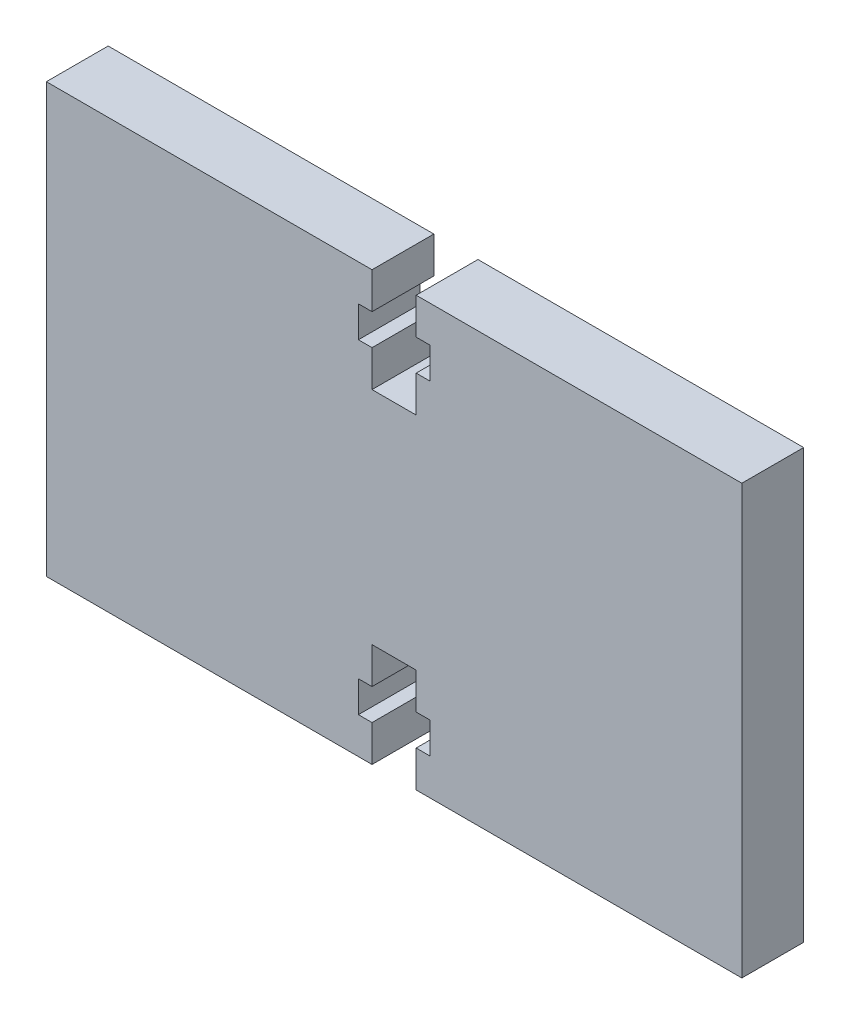
ISO-10303-21;
HEADER;
FILE_DESCRIPTION(('STEP AP214'),'2;1');
FILE_NAME('part.step','',(''),(''),'','','');
FILE_SCHEMA(('AUTOMOTIVE_DESIGN { 1 0 10303 214 1 1 1 1 }'));
ENDSEC;
DATA;
#1=APPLICATION_CONTEXT('core data for automotive mechanical design processes');
#2=APPLICATION_PROTOCOL_DEFINITION('international standard','automotive_design',2000,#1);
#3=PRODUCT_CONTEXT('',#1,'mechanical');
#4=PRODUCT('Part','Part','',(#3));
#5=PRODUCT_RELATED_PRODUCT_CATEGORY('part','',(#4));
#6=PRODUCT_DEFINITION_FORMATION('','',#4);
#7=PRODUCT_DEFINITION_CONTEXT('part definition',#1,'design');
#8=PRODUCT_DEFINITION('design','',#6,#7);
#9=PRODUCT_DEFINITION_SHAPE('','',#8);
#10=(LENGTH_UNIT() NAMED_UNIT(*) SI_UNIT(.MILLI.,.METRE.));
#11=(NAMED_UNIT(*) PLANE_ANGLE_UNIT() SI_UNIT($,.RADIAN.));
#12=(NAMED_UNIT(*) SI_UNIT($,.STERADIAN.) SOLID_ANGLE_UNIT());
#13=UNCERTAINTY_MEASURE_WITH_UNIT(LENGTH_MEASURE(1.E-05),#10,'distance_accuracy_value','');
#14=(GEOMETRIC_REPRESENTATION_CONTEXT(3) GLOBAL_UNCERTAINTY_ASSIGNED_CONTEXT((#13)) GLOBAL_UNIT_ASSIGNED_CONTEXT((#10,
#11,#12)) REPRESENTATION_CONTEXT('',''));
#15=CARTESIAN_POINT('',(0.,0.,0.));
#16=DIRECTION('',(0.,0.,1.));
#17=DIRECTION('',(1.,0.,0.));
#18=AXIS2_PLACEMENT_3D('',#15,#16,#17);
#19=CARTESIAN_POINT('',(-26.797,0.,4.7625));
#20=DIRECTION('',(-1.,0.,0.));
#21=DIRECTION('',(0.,0.,1.));
#22=AXIS2_PLACEMENT_3D('',#19,#20,#21);
#23=PLANE('',#22);
#24=DIRECTION('',(0.,1.,0.));
#25=VECTOR('',#24,1.);
#26=CARTESIAN_POINT('',(-26.797,0.,0.));
#27=LINE('',#26,#25);
#28=CARTESIAN_POINT('',(-26.797,-16.51,0.));
#29=VERTEX_POINT('',#28);
#30=CARTESIAN_POINT('',(-26.797,16.51,0.));
#31=VERTEX_POINT('',#30);
#32=EDGE_CURVE('E250',#29,#31,#27,.T.);
#33=ORIENTED_EDGE('',*,*,#32,.F.);
#34=DIRECTION('',(0.,0.,-1.));
#35=VECTOR('',#34,1.);
#36=CARTESIAN_POINT('',(-26.797,-16.51,4.7625));
#37=LINE('',#36,#35);
#38=CARTESIAN_POINT('',(-26.797,-16.51,4.7625));
#39=VERTEX_POINT('',#38);
#40=EDGE_CURVE('E11',#39,#29,#37,.T.);
#41=ORIENTED_EDGE('',*,*,#40,.F.);
#42=DIRECTION('',(0.,1.,0.));
#43=VECTOR('',#42,1.);
#44=CARTESIAN_POINT('',(-26.797,0.,4.7625));
#45=LINE('',#44,#43);
#46=CARTESIAN_POINT('',(-26.797,16.51,4.7625));
#47=VERTEX_POINT('',#46);
#48=EDGE_CURVE('E322',#39,#47,#45,.T.);
#49=ORIENTED_EDGE('',*,*,#48,.T.);
#50=DIRECTION('',(0.,0.,-1.));
#51=VECTOR('',#50,1.);
#52=CARTESIAN_POINT('',(-26.797,16.51,4.7625));
#53=LINE('',#52,#51);
#54=EDGE_CURVE('E52',#47,#31,#53,.T.);
#55=ORIENTED_EDGE('',*,*,#54,.T.);
#56=EDGE_LOOP('',(#33,#41,#49,#55));
#57=FACE_BOUND('',#56,.T.);
#58=ADVANCED_FACE('F36',(#57),#23,.T.);
#59=CARTESIAN_POINT('',(0.,-16.51,4.7625));
#60=DIRECTION('',(0.,1.,0.));
#61=DIRECTION('',(0.,0.,1.));
#62=AXIS2_PLACEMENT_3D('',#59,#60,#61);
#63=PLANE('',#62);
#64=DIRECTION('',(1.,0.,0.));
#65=VECTOR('',#64,1.);
#66=CARTESIAN_POINT('',(0.,-16.51,0.));
#67=LINE('',#66,#65);
#68=CARTESIAN_POINT('',(-1.7,-16.51,0.));
#69=VERTEX_POINT('',#68);
#70=EDGE_CURVE('E253',#29,#69,#67,.T.);
#71=ORIENTED_EDGE('',*,*,#70,.T.);
#72=DIRECTION('',(0.,0.,-1.));
#73=VECTOR('',#72,1.);
#74=CARTESIAN_POINT('',(-1.7,-16.51,4.7625));
#75=LINE('',#74,#73);
#76=CARTESIAN_POINT('',(-1.7,-16.51,4.7625));
#77=VERTEX_POINT('',#76);
#78=EDGE_CURVE('E44',#77,#69,#75,.T.);
#79=ORIENTED_EDGE('',*,*,#78,.F.);
#80=DIRECTION('',(1.,0.,0.));
#81=VECTOR('',#80,1.);
#82=CARTESIAN_POINT('',(0.,-16.51,4.7625));
#83=LINE('',#82,#81);
#84=EDGE_CURVE('E757',#39,#77,#83,.T.);
#85=ORIENTED_EDGE('',*,*,#84,.F.);
#86=ORIENTED_EDGE('',*,*,#40,.T.);
#87=EDGE_LOOP('',(#71,#79,#85,#86));
#88=FACE_BOUND('',#87,.T.);
#89=ADVANCED_FACE('F472',(#88),#63,.F.);
#90=CARTESIAN_POINT('',(-1.7,0.,4.7625));
#91=DIRECTION('',(-1.,0.,0.));
#92=DIRECTION('',(0.,-1.,0.));
#93=AXIS2_PLACEMENT_3D('',#90,#91,#92);
#94=PLANE('',#93);
#95=DIRECTION('',(0.,1.,0.));
#96=VECTOR('',#95,1.);
#97=CARTESIAN_POINT('',(-1.7,0.,0.));
#98=LINE('',#97,#96);
#99=CARTESIAN_POINT('',(-1.7,-13.71,0.));
#100=VERTEX_POINT('',#99);
#101=EDGE_CURVE('E255',#69,#100,#98,.T.);
#102=ORIENTED_EDGE('',*,*,#101,.T.);
#103=DIRECTION('',(0.,0.,-1.));
#104=VECTOR('',#103,1.);
#105=CARTESIAN_POINT('',(-1.7,-13.71,4.7625));
#106=LINE('',#105,#104);
#107=CARTESIAN_POINT('',(-1.7,-13.71,4.7625));
#108=VERTEX_POINT('',#107);
#109=EDGE_CURVE('E378',#108,#100,#106,.T.);
#110=ORIENTED_EDGE('',*,*,#109,.F.);
#111=DIRECTION('',(0.,1.,0.));
#112=VECTOR('',#111,1.);
#113=CARTESIAN_POINT('',(-1.7,0.,4.7625));
#114=LINE('',#113,#112);
#115=EDGE_CURVE('E388',#77,#108,#114,.T.);
#116=ORIENTED_EDGE('',*,*,#115,.F.);
#117=ORIENTED_EDGE('',*,*,#78,.T.);
#118=EDGE_LOOP('',(#102,#110,#116,#117));
#119=FACE_BOUND('',#118,.T.);
#120=ADVANCED_FACE('F386',(#119),#94,.F.);
#121=CARTESIAN_POINT('',(0.,-13.71,4.7625));
#122=DIRECTION('',(0.,-1.,0.));
#123=DIRECTION('',(0.,0.,-1.));
#124=AXIS2_PLACEMENT_3D('',#121,#122,#123);
#125=PLANE('',#124);
#126=DIRECTION('',(-1.,0.,0.));
#127=VECTOR('',#126,1.);
#128=CARTESIAN_POINT('',(0.,-13.71,0.));
#129=LINE('',#128,#127);
#130=CARTESIAN_POINT('',(-2.75,-13.71,0.));
#131=VERTEX_POINT('',#130);
#132=EDGE_CURVE('E258',#100,#131,#129,.T.);
#133=ORIENTED_EDGE('',*,*,#132,.T.);
#134=DIRECTION('',(0.,0.,-1.));
#135=VECTOR('',#134,1.);
#136=CARTESIAN_POINT('',(-2.75,-13.71,4.7625));
#137=LINE('',#136,#135);
#138=CARTESIAN_POINT('',(-2.75,-13.71,4.7625));
#139=VERTEX_POINT('',#138);
#140=EDGE_CURVE('E375',#139,#131,#137,.T.);
#141=ORIENTED_EDGE('',*,*,#140,.F.);
#142=DIRECTION('',(-1.,0.,0.));
#143=VECTOR('',#142,1.);
#144=CARTESIAN_POINT('',(0.,-13.71,4.7625));
#145=LINE('',#144,#143);
#146=EDGE_CURVE('E407',#108,#139,#145,.T.);
#147=ORIENTED_EDGE('',*,*,#146,.F.);
#148=ORIENTED_EDGE('',*,*,#109,.T.);
#149=EDGE_LOOP('',(#133,#141,#147,#148));
#150=FACE_BOUND('',#149,.T.);
#151=ADVANCED_FACE('F398',(#150),#125,.F.);
#152=CARTESIAN_POINT('',(-2.75,0.,4.7625));
#153=DIRECTION('',(-1.,0.,0.));
#154=DIRECTION('',(0.,0.,1.));
#155=AXIS2_PLACEMENT_3D('',#152,#153,#154);
#156=PLANE('',#155);
#157=DIRECTION('',(0.,1.,0.));
#158=VECTOR('',#157,1.);
#159=CARTESIAN_POINT('',(-2.75,0.,0.));
#160=LINE('',#159,#158);
#161=CARTESIAN_POINT('',(-2.75,-11.31,0.));
#162=VERTEX_POINT('',#161);
#163=EDGE_CURVE('E260',#131,#162,#160,.T.);
#164=ORIENTED_EDGE('',*,*,#163,.T.);
#165=DIRECTION('',(0.,0.,-1.));
#166=VECTOR('',#165,1.);
#167=CARTESIAN_POINT('',(-2.75,-11.31,4.7625));
#168=LINE('',#167,#166);
#169=CARTESIAN_POINT('',(-2.75,-11.31,4.7625));
#170=VERTEX_POINT('',#169);
#171=EDGE_CURVE('E372',#170,#162,#168,.T.);
#172=ORIENTED_EDGE('',*,*,#171,.F.);
#173=DIRECTION('',(0.,1.,0.));
#174=VECTOR('',#173,1.);
#175=CARTESIAN_POINT('',(-2.75,0.,4.7625));
#176=LINE('',#175,#174);
#177=EDGE_CURVE('E404',#139,#170,#176,.T.);
#178=ORIENTED_EDGE('',*,*,#177,.F.);
#179=ORIENTED_EDGE('',*,*,#140,.T.);
#180=EDGE_LOOP('',(#164,#172,#178,#179));
#181=FACE_BOUND('',#180,.T.);
#182=ADVANCED_FACE('F402',(#181),#156,.F.);
#183=CARTESIAN_POINT('',(0.,-11.31,4.7625));
#184=DIRECTION('',(0.,1.,0.));
#185=DIRECTION('',(0.,0.,1.));
#186=AXIS2_PLACEMENT_3D('',#183,#184,#185);
#187=PLANE('',#186);
#188=DIRECTION('',(1.,0.,0.));
#189=VECTOR('',#188,1.);
#190=CARTESIAN_POINT('',(0.,-11.31,0.));
#191=LINE('',#190,#189);
#192=CARTESIAN_POINT('',(-1.7,-11.31,0.));
#193=VERTEX_POINT('',#192);
#194=EDGE_CURVE('E262',#162,#193,#191,.T.);
#195=ORIENTED_EDGE('',*,*,#194,.T.);
#196=DIRECTION('',(0.,0.,-1.));
#197=VECTOR('',#196,1.);
#198=CARTESIAN_POINT('',(-1.7,-11.31,4.7625));
#199=LINE('',#198,#197);
#200=CARTESIAN_POINT('',(-1.7,-11.31,4.7625));
#201=VERTEX_POINT('',#200);
#202=EDGE_CURVE('E369',#201,#193,#199,.T.);
#203=ORIENTED_EDGE('',*,*,#202,.F.);
#204=DIRECTION('',(1.,0.,0.));
#205=VECTOR('',#204,1.);
#206=CARTESIAN_POINT('',(0.,-11.31,4.7625));
#207=LINE('',#206,#205);
#208=EDGE_CURVE('E406',#170,#201,#207,.T.);
#209=ORIENTED_EDGE('',*,*,#208,.F.);
#210=ORIENTED_EDGE('',*,*,#171,.T.);
#211=EDGE_LOOP('',(#195,#203,#209,#210));
#212=FACE_BOUND('',#211,.T.);
#213=ADVANCED_FACE('F485',(#212),#187,.F.);
#214=CARTESIAN_POINT('',(-1.7,0.,4.7625));
#215=DIRECTION('',(-1.,0.,0.));
#216=DIRECTION('',(0.,-1.,0.));
#217=AXIS2_PLACEMENT_3D('',#214,#215,#216);
#218=PLANE('',#217);
#219=DIRECTION('',(0.,1.,0.));
#220=VECTOR('',#219,1.);
#221=CARTESIAN_POINT('',(-1.7,0.,0.));
#222=LINE('',#221,#220);
#223=CARTESIAN_POINT('',(-1.7,-8.51,0.));
#224=VERTEX_POINT('',#223);
#225=EDGE_CURVE('E264',#193,#224,#222,.T.);
#226=ORIENTED_EDGE('',*,*,#225,.T.);
#227=DIRECTION('',(0.,0.,-1.));
#228=VECTOR('',#227,1.);
#229=CARTESIAN_POINT('',(-1.7,-8.51,4.7625));
#230=LINE('',#229,#228);
#231=CARTESIAN_POINT('',(-1.7,-8.51,4.7625));
#232=VERTEX_POINT('',#231);
#233=EDGE_CURVE('E366',#232,#224,#230,.T.);
#234=ORIENTED_EDGE('',*,*,#233,.F.);
#235=DIRECTION('',(0.,1.,0.));
#236=VECTOR('',#235,1.);
#237=CARTESIAN_POINT('',(-1.7,0.,4.7625));
#238=LINE('',#237,#236);
#239=EDGE_CURVE('E409',#201,#232,#238,.T.);
#240=ORIENTED_EDGE('',*,*,#239,.F.);
#241=ORIENTED_EDGE('',*,*,#202,.T.);
#242=EDGE_LOOP('',(#226,#234,#240,#241));
#243=FACE_BOUND('',#242,.T.);
#244=ADVANCED_FACE('F488',(#243),#218,.F.);
#245=CARTESIAN_POINT('',(0.,-8.51,4.7625));
#246=DIRECTION('',(0.,1.,0.));
#247=DIRECTION('',(-1.,0.,0.));
#248=AXIS2_PLACEMENT_3D('',#245,#246,#247);
#249=PLANE('',#248);
#250=DIRECTION('',(1.,0.,0.));
#251=VECTOR('',#250,1.);
#252=CARTESIAN_POINT('',(0.,-8.51,0.));
#253=LINE('',#252,#251);
#254=CARTESIAN_POINT('',(1.69999999999997,-8.51,0.));
#255=VERTEX_POINT('',#254);
#256=EDGE_CURVE('E266',#224,#255,#253,.T.);
#257=ORIENTED_EDGE('',*,*,#256,.T.);
#258=DIRECTION('',(0.,0.,-1.));
#259=VECTOR('',#258,1.);
#260=CARTESIAN_POINT('',(1.69999999999997,-8.51,4.7625));
#261=LINE('',#260,#259);
#262=CARTESIAN_POINT('',(1.69999999999997,-8.51,4.7625));
#263=VERTEX_POINT('',#262);
#264=EDGE_CURVE('E364',#263,#255,#261,.T.);
#265=ORIENTED_EDGE('',*,*,#264,.F.);
#266=DIRECTION('',(1.,0.,0.));
#267=VECTOR('',#266,1.);
#268=CARTESIAN_POINT('',(0.,-8.51,4.7625));
#269=LINE('',#268,#267);
#270=EDGE_CURVE('E415',#232,#263,#269,.T.);
#271=ORIENTED_EDGE('',*,*,#270,.F.);
#272=ORIENTED_EDGE('',*,*,#233,.T.);
#273=EDGE_LOOP('',(#257,#265,#271,#272));
#274=FACE_BOUND('',#273,.T.);
#275=ADVANCED_FACE('F492',(#274),#249,.F.);
#276=CARTESIAN_POINT('',(1.69999999999988,0.,4.7625));
#277=DIRECTION('',(-1.,0.,0.));
#278=DIRECTION('',(0.,-1.,0.));
#279=AXIS2_PLACEMENT_3D('',#276,#277,#278);
#280=PLANE('',#279);
#281=DIRECTION('',(0.,1.,0.));
#282=VECTOR('',#281,1.);
#283=CARTESIAN_POINT('',(1.69999999999988,0.,0.));
#284=LINE('',#283,#282);
#285=CARTESIAN_POINT('',(1.7,-11.31,0.));
#286=VERTEX_POINT('',#285);
#287=EDGE_CURVE('E269',#286,#255,#284,.T.);
#288=ORIENTED_EDGE('',*,*,#287,.F.);
#289=DIRECTION('',(0.,0.,-1.));
#290=VECTOR('',#289,1.);
#291=CARTESIAN_POINT('',(1.7,-11.31,4.7625));
#292=LINE('',#291,#290);
#293=CARTESIAN_POINT('',(1.7,-11.31,4.7625));
#294=VERTEX_POINT('',#293);
#295=EDGE_CURVE('E362',#294,#286,#292,.T.);
#296=ORIENTED_EDGE('',*,*,#295,.F.);
#297=DIRECTION('',(0.,1.,0.));
#298=VECTOR('',#297,1.);
#299=CARTESIAN_POINT('',(1.69999999999988,0.,4.7625));
#300=LINE('',#299,#298);
#301=EDGE_CURVE('E417',#294,#263,#300,.T.);
#302=ORIENTED_EDGE('',*,*,#301,.T.);
#303=ORIENTED_EDGE('',*,*,#264,.T.);
#304=EDGE_LOOP('',(#288,#296,#302,#303));
#305=FACE_BOUND('',#304,.T.);
#306=ADVANCED_FACE('F496',(#305),#280,.T.);
#307=CARTESIAN_POINT('',(0.,-11.31,4.7625));
#308=DIRECTION('',(0.,-1.,0.));
#309=DIRECTION('',(0.,0.,-1.));
#310=AXIS2_PLACEMENT_3D('',#307,#308,#309);
#311=PLANE('',#310);
#312=DIRECTION('',(-1.,0.,0.));
#313=VECTOR('',#312,1.);
#314=CARTESIAN_POINT('',(0.,-11.31,0.));
#315=LINE('',#314,#313);
#316=CARTESIAN_POINT('',(2.75,-11.31,0.));
#317=VERTEX_POINT('',#316);
#318=EDGE_CURVE('E272',#317,#286,#315,.T.);
#319=ORIENTED_EDGE('',*,*,#318,.F.);
#320=DIRECTION('',(0.,0.,-1.));
#321=VECTOR('',#320,1.);
#322=CARTESIAN_POINT('',(2.75,-11.31,4.7625));
#323=LINE('',#322,#321);
#324=CARTESIAN_POINT('',(2.75,-11.31,4.7625));
#325=VERTEX_POINT('',#324);
#326=EDGE_CURVE('E360',#325,#317,#323,.T.);
#327=ORIENTED_EDGE('',*,*,#326,.F.);
#328=DIRECTION('',(-1.,0.,0.));
#329=VECTOR('',#328,1.);
#330=CARTESIAN_POINT('',(0.,-11.31,4.7625));
#331=LINE('',#330,#329);
#332=EDGE_CURVE('E420',#325,#294,#331,.T.);
#333=ORIENTED_EDGE('',*,*,#332,.T.);
#334=ORIENTED_EDGE('',*,*,#295,.T.);
#335=EDGE_LOOP('',(#319,#327,#333,#334));
#336=FACE_BOUND('',#335,.T.);
#337=ADVANCED_FACE('F500',(#336),#311,.T.);
#338=CARTESIAN_POINT('',(2.75,0.,4.7625));
#339=DIRECTION('',(-1.,0.,0.));
#340=DIRECTION('',(0.,0.,1.));
#341=AXIS2_PLACEMENT_3D('',#338,#339,#340);
#342=PLANE('',#341);
#343=DIRECTION('',(0.,1.,0.));
#344=VECTOR('',#343,1.);
#345=CARTESIAN_POINT('',(2.75,0.,0.));
#346=LINE('',#345,#344);
#347=CARTESIAN_POINT('',(2.75,-13.71,0.));
#348=VERTEX_POINT('',#347);
#349=EDGE_CURVE('E275',#348,#317,#346,.T.);
#350=ORIENTED_EDGE('',*,*,#349,.F.);
#351=DIRECTION('',(0.,0.,-1.));
#352=VECTOR('',#351,1.);
#353=CARTESIAN_POINT('',(2.75,-13.71,4.7625));
#354=LINE('',#353,#352);
#355=CARTESIAN_POINT('',(2.75,-13.71,4.7625));
#356=VERTEX_POINT('',#355);
#357=EDGE_CURVE('E358',#356,#348,#354,.T.);
#358=ORIENTED_EDGE('',*,*,#357,.F.);
#359=DIRECTION('',(0.,1.,0.));
#360=VECTOR('',#359,1.);
#361=CARTESIAN_POINT('',(2.75,0.,4.7625));
#362=LINE('',#361,#360);
#363=EDGE_CURVE('E423',#356,#325,#362,.T.);
#364=ORIENTED_EDGE('',*,*,#363,.T.);
#365=ORIENTED_EDGE('',*,*,#326,.T.);
#366=EDGE_LOOP('',(#350,#358,#364,#365));
#367=FACE_BOUND('',#366,.T.);
#368=ADVANCED_FACE('F504',(#367),#342,.T.);
#369=CARTESIAN_POINT('',(0.,-13.71,4.7625));
#370=DIRECTION('',(0.,1.,0.));
#371=DIRECTION('',(0.,0.,1.));
#372=AXIS2_PLACEMENT_3D('',#369,#370,#371);
#373=PLANE('',#372);
#374=DIRECTION('',(1.,0.,0.));
#375=VECTOR('',#374,1.);
#376=CARTESIAN_POINT('',(0.,-13.71,0.));
#377=LINE('',#376,#375);
#378=CARTESIAN_POINT('',(1.7,-13.71,0.));
#379=VERTEX_POINT('',#378);
#380=EDGE_CURVE('E278',#379,#348,#377,.T.);
#381=ORIENTED_EDGE('',*,*,#380,.F.);
#382=DIRECTION('',(0.,0.,-1.));
#383=VECTOR('',#382,1.);
#384=CARTESIAN_POINT('',(1.7,-13.71,4.7625));
#385=LINE('',#384,#383);
#386=CARTESIAN_POINT('',(1.7,-13.71,4.7625));
#387=VERTEX_POINT('',#386);
#388=EDGE_CURVE('E356',#387,#379,#385,.T.);
#389=ORIENTED_EDGE('',*,*,#388,.F.);
#390=DIRECTION('',(1.,0.,0.));
#391=VECTOR('',#390,1.);
#392=CARTESIAN_POINT('',(0.,-13.71,4.7625));
#393=LINE('',#392,#391);
#394=EDGE_CURVE('E426',#387,#356,#393,.T.);
#395=ORIENTED_EDGE('',*,*,#394,.T.);
#396=ORIENTED_EDGE('',*,*,#357,.T.);
#397=EDGE_LOOP('',(#381,#389,#395,#396));
#398=FACE_BOUND('',#397,.T.);
#399=ADVANCED_FACE('F508',(#398),#373,.T.);
#400=CARTESIAN_POINT('',(1.70000000000004,0.,4.7625));
#401=DIRECTION('',(-1.,0.,0.));
#402=DIRECTION('',(0.,-1.,0.));
#403=AXIS2_PLACEMENT_3D('',#400,#401,#402);
#404=PLANE('',#403);
#405=DIRECTION('',(0.,1.,0.));
#406=VECTOR('',#405,1.);
#407=CARTESIAN_POINT('',(1.70000000000004,0.,0.));
#408=LINE('',#407,#406);
#409=CARTESIAN_POINT('',(1.69999999999999,-16.51,0.));
#410=VERTEX_POINT('',#409);
#411=EDGE_CURVE('E281',#410,#379,#408,.T.);
#412=ORIENTED_EDGE('',*,*,#411,.F.);
#413=DIRECTION('',(0.,0.,-1.));
#414=VECTOR('',#413,1.);
#415=CARTESIAN_POINT('',(1.69999999999999,-16.51,4.7625));
#416=LINE('',#415,#414);
#417=CARTESIAN_POINT('',(1.69999999999999,-16.51,4.7625));
#418=VERTEX_POINT('',#417);
#419=EDGE_CURVE('E354',#418,#410,#416,.T.);
#420=ORIENTED_EDGE('',*,*,#419,.F.);
#421=DIRECTION('',(0.,1.,0.));
#422=VECTOR('',#421,1.);
#423=CARTESIAN_POINT('',(1.70000000000004,0.,4.7625));
#424=LINE('',#423,#422);
#425=EDGE_CURVE('E429',#418,#387,#424,.T.);
#426=ORIENTED_EDGE('',*,*,#425,.T.);
#427=ORIENTED_EDGE('',*,*,#388,.T.);
#428=EDGE_LOOP('',(#412,#420,#426,#427));
#429=FACE_BOUND('',#428,.T.);
#430=ADVANCED_FACE('F512',(#429),#404,.T.);
#431=CARTESIAN_POINT('',(0.,-16.51,4.7625));
#432=DIRECTION('',(0.,1.,0.));
#433=DIRECTION('',(-1.,0.,0.));
#434=AXIS2_PLACEMENT_3D('',#431,#432,#433);
#435=PLANE('',#434);
#436=DIRECTION('',(1.,0.,0.));
#437=VECTOR('',#436,1.);
#438=CARTESIAN_POINT('',(0.,-16.51,0.));
#439=LINE('',#438,#437);
#440=CARTESIAN_POINT('',(26.797,-16.51,0.));
#441=VERTEX_POINT('',#440);
#442=EDGE_CURVE('E284',#410,#441,#439,.T.);
#443=ORIENTED_EDGE('',*,*,#442,.T.);
#444=DIRECTION('',(0.,0.,-1.));
#445=VECTOR('',#444,1.);
#446=CARTESIAN_POINT('',(26.797,-16.51,4.7625));
#447=LINE('',#446,#445);
#448=CARTESIAN_POINT('',(26.797,-16.51,4.7625));
#449=VERTEX_POINT('',#448);
#450=EDGE_CURVE('E351',#449,#441,#447,.T.);
#451=ORIENTED_EDGE('',*,*,#450,.F.);
#452=DIRECTION('',(1.,0.,0.));
#453=VECTOR('',#452,1.);
#454=CARTESIAN_POINT('',(0.,-16.51,4.7625));
#455=LINE('',#454,#453);
#456=EDGE_CURVE('E432',#418,#449,#455,.T.);
#457=ORIENTED_EDGE('',*,*,#456,.F.);
#458=ORIENTED_EDGE('',*,*,#419,.T.);
#459=EDGE_LOOP('',(#443,#451,#457,#458));
#460=FACE_BOUND('',#459,.T.);
#461=ADVANCED_FACE('F516',(#460),#435,.F.);
#462=CARTESIAN_POINT('',(26.797,0.,4.7625));
#463=DIRECTION('',(-1.,0.,0.));
#464=DIRECTION('',(0.,0.,1.));
#465=AXIS2_PLACEMENT_3D('',#462,#463,#464);
#466=PLANE('',#465);
#467=DIRECTION('',(0.,1.,0.));
#468=VECTOR('',#467,1.);
#469=CARTESIAN_POINT('',(26.797,0.,0.));
#470=LINE('',#469,#468);
#471=CARTESIAN_POINT('',(26.797,16.51,0.));
#472=VERTEX_POINT('',#471);
#473=EDGE_CURVE('E286',#441,#472,#470,.T.);
#474=ORIENTED_EDGE('',*,*,#473,.T.);
#475=DIRECTION('',(0.,0.,-1.));
#476=VECTOR('',#475,1.);
#477=CARTESIAN_POINT('',(26.797,16.51,4.7625));
#478=LINE('',#477,#476);
#479=CARTESIAN_POINT('',(26.797,16.51,4.7625));
#480=VERTEX_POINT('',#479);
#481=EDGE_CURVE('E349',#480,#472,#478,.T.);
#482=ORIENTED_EDGE('',*,*,#481,.F.);
#483=DIRECTION('',(0.,1.,0.));
#484=VECTOR('',#483,1.);
#485=CARTESIAN_POINT('',(26.797,0.,4.7625));
#486=LINE('',#485,#484);
#487=EDGE_CURVE('E434',#449,#480,#486,.T.);
#488=ORIENTED_EDGE('',*,*,#487,.F.);
#489=ORIENTED_EDGE('',*,*,#450,.T.);
#490=EDGE_LOOP('',(#474,#482,#488,#489));
#491=FACE_BOUND('',#490,.T.);
#492=ADVANCED_FACE('F520',(#491),#466,.F.);
#493=CARTESIAN_POINT('',(0.,16.51,4.7625));
#494=DIRECTION('',(0.,1.,0.));
#495=DIRECTION('',(-1.,0.,0.));
#496=AXIS2_PLACEMENT_3D('',#493,#494,#495);
#497=PLANE('',#496);
#498=DIRECTION('',(1.,0.,0.));
#499=VECTOR('',#498,1.);
#500=CARTESIAN_POINT('',(0.,16.51,0.));
#501=LINE('',#500,#499);
#502=CARTESIAN_POINT('',(1.69999999999999,16.51,0.));
#503=VERTEX_POINT('',#502);
#504=EDGE_CURVE('E289',#503,#472,#501,.T.);
#505=ORIENTED_EDGE('',*,*,#504,.F.);
#506=DIRECTION('',(0.,0.,-1.));
#507=VECTOR('',#506,1.);
#508=CARTESIAN_POINT('',(1.69999999999999,16.51,4.7625));
#509=LINE('',#508,#507);
#510=CARTESIAN_POINT('',(1.69999999999999,16.51,4.7625));
#511=VERTEX_POINT('',#510);
#512=EDGE_CURVE('E347',#511,#503,#509,.T.);
#513=ORIENTED_EDGE('',*,*,#512,.F.);
#514=DIRECTION('',(1.,0.,0.));
#515=VECTOR('',#514,1.);
#516=CARTESIAN_POINT('',(0.,16.51,4.7625));
#517=LINE('',#516,#515);
#518=EDGE_CURVE('E436',#511,#480,#517,.T.);
#519=ORIENTED_EDGE('',*,*,#518,.T.);
#520=ORIENTED_EDGE('',*,*,#481,.T.);
#521=EDGE_LOOP('',(#505,#513,#519,#520));
#522=FACE_BOUND('',#521,.T.);
#523=ADVANCED_FACE('F524',(#522),#497,.T.);
#524=CARTESIAN_POINT('',(1.70000000000004,0.,4.7625));
#525=DIRECTION('',(1.,0.,0.));
#526=DIRECTION('',(0.,1.,0.));
#527=AXIS2_PLACEMENT_3D('',#524,#525,#526);
#528=PLANE('',#527);
#529=DIRECTION('',(0.,-1.,0.));
#530=VECTOR('',#529,1.);
#531=CARTESIAN_POINT('',(1.70000000000004,0.,0.));
#532=LINE('',#531,#530);
#533=CARTESIAN_POINT('',(1.7,13.71,0.));
#534=VERTEX_POINT('',#533);
#535=EDGE_CURVE('E292',#503,#534,#532,.T.);
#536=ORIENTED_EDGE('',*,*,#535,.T.);
#537=DIRECTION('',(0.,0.,-1.));
#538=VECTOR('',#537,1.);
#539=CARTESIAN_POINT('',(1.7,13.71,4.7625));
#540=LINE('',#539,#538);
#541=CARTESIAN_POINT('',(1.7,13.71,4.7625));
#542=VERTEX_POINT('',#541);
#543=EDGE_CURVE('E344',#542,#534,#540,.T.);
#544=ORIENTED_EDGE('',*,*,#543,.F.);
#545=DIRECTION('',(0.,-1.,0.));
#546=VECTOR('',#545,1.);
#547=CARTESIAN_POINT('',(1.70000000000004,0.,4.7625));
#548=LINE('',#547,#546);
#549=EDGE_CURVE('E439',#511,#542,#548,.T.);
#550=ORIENTED_EDGE('',*,*,#549,.F.);
#551=ORIENTED_EDGE('',*,*,#512,.T.);
#552=EDGE_LOOP('',(#536,#544,#550,#551));
#553=FACE_BOUND('',#552,.T.);
#554=ADVANCED_FACE('F528',(#553),#528,.F.);
#555=CARTESIAN_POINT('',(0.,13.71,4.7625));
#556=DIRECTION('',(0.,1.,0.));
#557=DIRECTION('',(0.,0.,1.));
#558=AXIS2_PLACEMENT_3D('',#555,#556,#557);
#559=PLANE('',#558);
#560=DIRECTION('',(1.,0.,0.));
#561=VECTOR('',#560,1.);
#562=CARTESIAN_POINT('',(0.,13.71,0.));
#563=LINE('',#562,#561);
#564=CARTESIAN_POINT('',(2.75,13.71,0.));
#565=VERTEX_POINT('',#564);
#566=EDGE_CURVE('E295',#534,#565,#563,.T.);
#567=ORIENTED_EDGE('',*,*,#566,.T.);
#568=DIRECTION('',(0.,0.,-1.));
#569=VECTOR('',#568,1.);
#570=CARTESIAN_POINT('',(2.75,13.71,4.7625));
#571=LINE('',#570,#569);
#572=CARTESIAN_POINT('',(2.75,13.71,4.7625));
#573=VERTEX_POINT('',#572);
#574=EDGE_CURVE('E341',#573,#565,#571,.T.);
#575=ORIENTED_EDGE('',*,*,#574,.F.);
#576=DIRECTION('',(1.,0.,0.));
#577=VECTOR('',#576,1.);
#578=CARTESIAN_POINT('',(0.,13.71,4.7625));
#579=LINE('',#578,#577);
#580=EDGE_CURVE('E441',#542,#573,#579,.T.);
#581=ORIENTED_EDGE('',*,*,#580,.F.);
#582=ORIENTED_EDGE('',*,*,#543,.T.);
#583=EDGE_LOOP('',(#567,#575,#581,#582));
#584=FACE_BOUND('',#583,.T.);
#585=ADVANCED_FACE('F532',(#584),#559,.F.);
#586=CARTESIAN_POINT('',(2.75,0.,4.7625));
#587=DIRECTION('',(1.,0.,0.));
#588=DIRECTION('',(0.,0.,-1.));
#589=AXIS2_PLACEMENT_3D('',#586,#587,#588);
#590=PLANE('',#589);
#591=DIRECTION('',(0.,-1.,0.));
#592=VECTOR('',#591,1.);
#593=CARTESIAN_POINT('',(2.75,0.,0.));
#594=LINE('',#593,#592);
#595=CARTESIAN_POINT('',(2.75,11.31,0.));
#596=VERTEX_POINT('',#595);
#597=EDGE_CURVE('E297',#565,#596,#594,.T.);
#598=ORIENTED_EDGE('',*,*,#597,.T.);
#599=DIRECTION('',(0.,0.,-1.));
#600=VECTOR('',#599,1.);
#601=CARTESIAN_POINT('',(2.75,11.31,4.7625));
#602=LINE('',#601,#600);
#603=CARTESIAN_POINT('',(2.75,11.31,4.7625));
#604=VERTEX_POINT('',#603);
#605=EDGE_CURVE('E338',#604,#596,#602,.T.);
#606=ORIENTED_EDGE('',*,*,#605,.F.);
#607=DIRECTION('',(0.,-1.,0.));
#608=VECTOR('',#607,1.);
#609=CARTESIAN_POINT('',(2.75,0.,4.7625));
#610=LINE('',#609,#608);
#611=EDGE_CURVE('E443',#573,#604,#610,.T.);
#612=ORIENTED_EDGE('',*,*,#611,.F.);
#613=ORIENTED_EDGE('',*,*,#574,.T.);
#614=EDGE_LOOP('',(#598,#606,#612,#613));
#615=FACE_BOUND('',#614,.T.);
#616=ADVANCED_FACE('F536',(#615),#590,.F.);
#617=CARTESIAN_POINT('',(0.,11.31,4.7625));
#618=DIRECTION('',(0.,-1.,0.));
#619=DIRECTION('',(0.,0.,-1.));
#620=AXIS2_PLACEMENT_3D('',#617,#618,#619);
#621=PLANE('',#620);
#622=DIRECTION('',(-1.,0.,0.));
#623=VECTOR('',#622,1.);
#624=CARTESIAN_POINT('',(0.,11.31,0.));
#625=LINE('',#624,#623);
#626=CARTESIAN_POINT('',(1.7,11.31,0.));
#627=VERTEX_POINT('',#626);
#628=EDGE_CURVE('E299',#596,#627,#625,.T.);
#629=ORIENTED_EDGE('',*,*,#628,.T.);
#630=DIRECTION('',(0.,0.,-1.));
#631=VECTOR('',#630,1.);
#632=CARTESIAN_POINT('',(1.7,11.31,4.7625));
#633=LINE('',#632,#631);
#634=CARTESIAN_POINT('',(1.7,11.31,4.7625));
#635=VERTEX_POINT('',#634);
#636=EDGE_CURVE('E334',#635,#627,#633,.T.);
#637=ORIENTED_EDGE('',*,*,#636,.F.);
#638=DIRECTION('',(-1.,0.,0.));
#639=VECTOR('',#638,1.);
#640=CARTESIAN_POINT('',(0.,11.31,4.7625));
#641=LINE('',#640,#639);
#642=EDGE_CURVE('E445',#604,#635,#641,.T.);
#643=ORIENTED_EDGE('',*,*,#642,.F.);
#644=ORIENTED_EDGE('',*,*,#605,.T.);
#645=EDGE_LOOP('',(#629,#637,#643,#644));
#646=FACE_BOUND('',#645,.T.);
#647=ADVANCED_FACE('F540',(#646),#621,.F.);
#648=CARTESIAN_POINT('',(1.69999999999988,0.,4.7625));
#649=DIRECTION('',(1.,0.,0.));
#650=DIRECTION('',(0.,1.,0.));
#651=AXIS2_PLACEMENT_3D('',#648,#649,#650);
#652=PLANE('',#651);
#653=DIRECTION('',(0.,-1.,0.));
#654=VECTOR('',#653,1.);
#655=CARTESIAN_POINT('',(1.69999999999988,0.,0.));
#656=LINE('',#655,#654);
#657=CARTESIAN_POINT('',(1.69999999999997,8.51,0.));
#658=VERTEX_POINT('',#657);
#659=EDGE_CURVE('E301',#627,#658,#656,.T.);
#660=ORIENTED_EDGE('',*,*,#659,.T.);
#661=DIRECTION('',(0.,0.,-1.));
#662=VECTOR('',#661,1.);
#663=CARTESIAN_POINT('',(1.69999999999997,8.51,4.7625));
#664=LINE('',#663,#662);
#665=CARTESIAN_POINT('',(1.69999999999997,8.51,4.7625));
#666=VERTEX_POINT('',#665);
#667=EDGE_CURVE('E332',#666,#658,#664,.T.);
#668=ORIENTED_EDGE('',*,*,#667,.F.);
#669=DIRECTION('',(0.,-1.,0.));
#670=VECTOR('',#669,1.);
#671=CARTESIAN_POINT('',(1.69999999999988,0.,4.7625));
#672=LINE('',#671,#670);
#673=EDGE_CURVE('E447',#635,#666,#672,.T.);
#674=ORIENTED_EDGE('',*,*,#673,.F.);
#675=ORIENTED_EDGE('',*,*,#636,.T.);
#676=EDGE_LOOP('',(#660,#668,#674,#675));
#677=FACE_BOUND('',#676,.T.);
#678=ADVANCED_FACE('F544',(#677),#652,.F.);
#679=CARTESIAN_POINT('',(0.,8.51,4.7625));
#680=DIRECTION('',(0.,1.,0.));
#681=DIRECTION('',(-1.,0.,0.));
#682=AXIS2_PLACEMENT_3D('',#679,#680,#681);
#683=PLANE('',#682);
#684=DIRECTION('',(1.,0.,0.));
#685=VECTOR('',#684,1.);
#686=CARTESIAN_POINT('',(0.,8.51,0.));
#687=LINE('',#686,#685);
#688=CARTESIAN_POINT('',(-1.7,8.51,0.));
#689=VERTEX_POINT('',#688);
#690=EDGE_CURVE('E304',#689,#658,#687,.T.);
#691=ORIENTED_EDGE('',*,*,#690,.F.);
#692=DIRECTION('',(0.,0.,-1.));
#693=VECTOR('',#692,1.);
#694=CARTESIAN_POINT('',(-1.7,8.51,4.7625));
#695=LINE('',#694,#693);
#696=CARTESIAN_POINT('',(-1.7,8.51,4.7625));
#697=VERTEX_POINT('',#696);
#698=EDGE_CURVE('E330',#697,#689,#695,.T.);
#699=ORIENTED_EDGE('',*,*,#698,.F.);
#700=DIRECTION('',(1.,0.,0.));
#701=VECTOR('',#700,1.);
#702=CARTESIAN_POINT('',(0.,8.51,4.7625));
#703=LINE('',#702,#701);
#704=EDGE_CURVE('E449',#697,#666,#703,.T.);
#705=ORIENTED_EDGE('',*,*,#704,.T.);
#706=ORIENTED_EDGE('',*,*,#667,.T.);
#707=EDGE_LOOP('',(#691,#699,#705,#706));
#708=FACE_BOUND('',#707,.T.);
#709=ADVANCED_FACE('F548',(#708),#683,.T.);
#710=CARTESIAN_POINT('',(-1.7,0.,4.7625));
#711=DIRECTION('',(1.,0.,0.));
#712=DIRECTION('',(0.,1.,0.));
#713=AXIS2_PLACEMENT_3D('',#710,#711,#712);
#714=PLANE('',#713);
#715=DIRECTION('',(0.,-1.,0.));
#716=VECTOR('',#715,1.);
#717=CARTESIAN_POINT('',(-1.7,0.,0.));
#718=LINE('',#717,#716);
#719=CARTESIAN_POINT('',(-1.7,11.31,0.));
#720=VERTEX_POINT('',#719);
#721=EDGE_CURVE('E307',#720,#689,#718,.T.);
#722=ORIENTED_EDGE('',*,*,#721,.F.);
#723=DIRECTION('',(0.,0.,-1.));
#724=VECTOR('',#723,1.);
#725=CARTESIAN_POINT('',(-1.7,11.31,4.7625));
#726=LINE('',#725,#724);
#727=CARTESIAN_POINT('',(-1.7,11.31,4.7625));
#728=VERTEX_POINT('',#727);
#729=EDGE_CURVE('E328',#728,#720,#726,.T.);
#730=ORIENTED_EDGE('',*,*,#729,.F.);
#731=DIRECTION('',(0.,-1.,0.));
#732=VECTOR('',#731,1.);
#733=CARTESIAN_POINT('',(-1.7,0.,4.7625));
#734=LINE('',#733,#732);
#735=EDGE_CURVE('E452',#728,#697,#734,.T.);
#736=ORIENTED_EDGE('',*,*,#735,.T.);
#737=ORIENTED_EDGE('',*,*,#698,.T.);
#738=EDGE_LOOP('',(#722,#730,#736,#737));
#739=FACE_BOUND('',#738,.T.);
#740=ADVANCED_FACE('F552',(#739),#714,.T.);
#741=CARTESIAN_POINT('',(0.,11.31,4.7625));
#742=DIRECTION('',(0.,1.,0.));
#743=DIRECTION('',(0.,0.,1.));
#744=AXIS2_PLACEMENT_3D('',#741,#742,#743);
#745=PLANE('',#744);
#746=DIRECTION('',(1.,0.,0.));
#747=VECTOR('',#746,1.);
#748=CARTESIAN_POINT('',(0.,11.31,0.));
#749=LINE('',#748,#747);
#750=CARTESIAN_POINT('',(-2.75,11.31,0.));
#751=VERTEX_POINT('',#750);
#752=EDGE_CURVE('E310',#751,#720,#749,.T.);
#753=ORIENTED_EDGE('',*,*,#752,.F.);
#754=DIRECTION('',(0.,0.,-1.));
#755=VECTOR('',#754,1.);
#756=CARTESIAN_POINT('',(-2.75,11.31,4.7625));
#757=LINE('',#756,#755);
#758=CARTESIAN_POINT('',(-2.75,11.31,4.7625));
#759=VERTEX_POINT('',#758);
#760=EDGE_CURVE('E326',#759,#751,#757,.T.);
#761=ORIENTED_EDGE('',*,*,#760,.F.);
#762=DIRECTION('',(1.,0.,0.));
#763=VECTOR('',#762,1.);
#764=CARTESIAN_POINT('',(0.,11.31,4.7625));
#765=LINE('',#764,#763);
#766=EDGE_CURVE('E455',#759,#728,#765,.T.);
#767=ORIENTED_EDGE('',*,*,#766,.T.);
#768=ORIENTED_EDGE('',*,*,#729,.T.);
#769=EDGE_LOOP('',(#753,#761,#767,#768));
#770=FACE_BOUND('',#769,.T.);
#771=ADVANCED_FACE('F556',(#770),#745,.T.);
#772=CARTESIAN_POINT('',(-2.75,0.,4.7625));
#773=DIRECTION('',(1.,0.,0.));
#774=DIRECTION('',(0.,0.,-1.));
#775=AXIS2_PLACEMENT_3D('',#772,#773,#774);
#776=PLANE('',#775);
#777=DIRECTION('',(0.,-1.,0.));
#778=VECTOR('',#777,1.);
#779=CARTESIAN_POINT('',(-2.75,0.,0.));
#780=LINE('',#779,#778);
#781=CARTESIAN_POINT('',(-2.75,13.71,0.));
#782=VERTEX_POINT('',#781);
#783=EDGE_CURVE('E313',#782,#751,#780,.T.);
#784=ORIENTED_EDGE('',*,*,#783,.F.);
#785=DIRECTION('',(0.,0.,-1.));
#786=VECTOR('',#785,1.);
#787=CARTESIAN_POINT('',(-2.75,13.71,4.7625));
#788=LINE('',#787,#786);
#789=CARTESIAN_POINT('',(-2.75,13.71,4.7625));
#790=VERTEX_POINT('',#789);
#791=EDGE_CURVE('E231',#790,#782,#788,.T.);
#792=ORIENTED_EDGE('',*,*,#791,.F.);
#793=DIRECTION('',(0.,-1.,0.));
#794=VECTOR('',#793,1.);
#795=CARTESIAN_POINT('',(-2.75,0.,4.7625));
#796=LINE('',#795,#794);
#797=EDGE_CURVE('E242',#790,#759,#796,.T.);
#798=ORIENTED_EDGE('',*,*,#797,.T.);
#799=ORIENTED_EDGE('',*,*,#760,.T.);
#800=EDGE_LOOP('',(#784,#792,#798,#799));
#801=FACE_BOUND('',#800,.T.);
#802=ADVANCED_FACE('F459',(#801),#776,.T.);
#803=CARTESIAN_POINT('',(0.,13.71,4.7625));
#804=DIRECTION('',(0.,-1.,0.));
#805=DIRECTION('',(0.,0.,-1.));
#806=AXIS2_PLACEMENT_3D('',#803,#804,#805);
#807=PLANE('',#806);
#808=DIRECTION('',(-1.,0.,0.));
#809=VECTOR('',#808,1.);
#810=CARTESIAN_POINT('',(0.,13.71,0.));
#811=LINE('',#810,#809);
#812=CARTESIAN_POINT('',(-1.7,13.71,0.));
#813=VERTEX_POINT('',#812);
#814=EDGE_CURVE('E227',#813,#782,#811,.T.);
#815=ORIENTED_EDGE('',*,*,#814,.F.);
#816=DIRECTION('',(0.,0.,-1.));
#817=VECTOR('',#816,1.);
#818=CARTESIAN_POINT('',(-1.7,13.71,4.7625));
#819=LINE('',#818,#817);
#820=CARTESIAN_POINT('',(-1.7,13.71,4.7625));
#821=VERTEX_POINT('',#820);
#822=EDGE_CURVE('E222',#821,#813,#819,.T.);
#823=ORIENTED_EDGE('',*,*,#822,.F.);
#824=DIRECTION('',(-1.,0.,0.));
#825=VECTOR('',#824,1.);
#826=CARTESIAN_POINT('',(0.,13.71,4.7625));
#827=LINE('',#826,#825);
#828=EDGE_CURVE('E225',#821,#790,#827,.T.);
#829=ORIENTED_EDGE('',*,*,#828,.T.);
#830=ORIENTED_EDGE('',*,*,#791,.T.);
#831=EDGE_LOOP('',(#815,#823,#829,#830));
#832=FACE_BOUND('',#831,.T.);
#833=ADVANCED_FACE('F224',(#832),#807,.T.);
#834=CARTESIAN_POINT('',(-1.7,0.,4.7625));
#835=DIRECTION('',(1.,0.,0.));
#836=DIRECTION('',(0.,1.,0.));
#837=AXIS2_PLACEMENT_3D('',#834,#835,#836);
#838=PLANE('',#837);
#839=DIRECTION('',(0.,-1.,0.));
#840=VECTOR('',#839,1.);
#841=CARTESIAN_POINT('',(-1.7,0.,0.));
#842=LINE('',#841,#840);
#843=CARTESIAN_POINT('',(-1.7,16.51,0.));
#844=VERTEX_POINT('',#843);
#845=EDGE_CURVE('E317',#844,#813,#842,.T.);
#846=ORIENTED_EDGE('',*,*,#845,.F.);
#847=DIRECTION('',(0.,0.,-1.));
#848=VECTOR('',#847,1.);
#849=CARTESIAN_POINT('',(-1.7,16.51,4.7625));
#850=LINE('',#849,#848);
#851=CARTESIAN_POINT('',(-1.7,16.51,4.7625));
#852=VERTEX_POINT('',#851);
#853=EDGE_CURVE('E137',#852,#844,#850,.T.);
#854=ORIENTED_EDGE('',*,*,#853,.F.);
#855=DIRECTION('',(0.,-1.,0.));
#856=VECTOR('',#855,1.);
#857=CARTESIAN_POINT('',(-1.7,0.,4.7625));
#858=LINE('',#857,#856);
#859=EDGE_CURVE('E239',#852,#821,#858,.T.);
#860=ORIENTED_EDGE('',*,*,#859,.T.);
#861=ORIENTED_EDGE('',*,*,#822,.T.);
#862=EDGE_LOOP('',(#846,#854,#860,#861));
#863=FACE_BOUND('',#862,.T.);
#864=ADVANCED_FACE('F244',(#863),#838,.T.);
#865=CARTESIAN_POINT('',(0.,16.51,4.7625));
#866=DIRECTION('',(0.,1.,0.));
#867=DIRECTION('',(0.,0.,1.));
#868=AXIS2_PLACEMENT_3D('',#865,#866,#867);
#869=PLANE('',#868);
#870=DIRECTION('',(1.,0.,0.));
#871=VECTOR('',#870,1.);
#872=CARTESIAN_POINT('',(0.,16.51,0.));
#873=LINE('',#872,#871);
#874=EDGE_CURVE('E319',#31,#844,#873,.T.);
#875=ORIENTED_EDGE('',*,*,#874,.F.);
#876=ORIENTED_EDGE('',*,*,#54,.F.);
#877=DIRECTION('',(1.,0.,0.));
#878=VECTOR('',#877,1.);
#879=CARTESIAN_POINT('',(0.,16.51,4.7625));
#880=LINE('',#879,#878);
#881=EDGE_CURVE('E245',#47,#852,#880,.T.);
#882=ORIENTED_EDGE('',*,*,#881,.T.);
#883=ORIENTED_EDGE('',*,*,#853,.T.);
#884=EDGE_LOOP('',(#875,#876,#882,#883));
#885=FACE_BOUND('',#884,.T.);
#886=ADVANCED_FACE('F461',(#885),#869,.T.);
#887=CARTESIAN_POINT('',(0.,0.,4.7625));
#888=DIRECTION('',(0.,0.,1.));
#889=DIRECTION('',(1.,0.,0.));
#890=AXIS2_PLACEMENT_3D('',#887,#888,#889);
#891=PLANE('',#890);
#892=ORIENTED_EDGE('',*,*,#48,.F.);
#893=ORIENTED_EDGE('',*,*,#84,.T.);
#894=ORIENTED_EDGE('',*,*,#115,.T.);
#895=ORIENTED_EDGE('',*,*,#146,.T.);
#896=ORIENTED_EDGE('',*,*,#177,.T.);
#897=ORIENTED_EDGE('',*,*,#208,.T.);
#898=ORIENTED_EDGE('',*,*,#239,.T.);
#899=ORIENTED_EDGE('',*,*,#270,.T.);
#900=ORIENTED_EDGE('',*,*,#301,.F.);
#901=ORIENTED_EDGE('',*,*,#332,.F.);
#902=ORIENTED_EDGE('',*,*,#363,.F.);
#903=ORIENTED_EDGE('',*,*,#394,.F.);
#904=ORIENTED_EDGE('',*,*,#425,.F.);
#905=ORIENTED_EDGE('',*,*,#456,.T.);
#906=ORIENTED_EDGE('',*,*,#487,.T.);
#907=ORIENTED_EDGE('',*,*,#518,.F.);
#908=ORIENTED_EDGE('',*,*,#549,.T.);
#909=ORIENTED_EDGE('',*,*,#580,.T.);
#910=ORIENTED_EDGE('',*,*,#611,.T.);
#911=ORIENTED_EDGE('',*,*,#642,.T.);
#912=ORIENTED_EDGE('',*,*,#673,.T.);
#913=ORIENTED_EDGE('',*,*,#704,.F.);
#914=ORIENTED_EDGE('',*,*,#735,.F.);
#915=ORIENTED_EDGE('',*,*,#766,.F.);
#916=ORIENTED_EDGE('',*,*,#797,.F.);
#917=ORIENTED_EDGE('',*,*,#828,.F.);
#918=ORIENTED_EDGE('',*,*,#859,.F.);
#919=ORIENTED_EDGE('',*,*,#881,.F.);
#920=EDGE_LOOP('',(#892,#893,#894,#895,#896,#897,#898,#899,#900,#901,#902,#903,#904,#905,#906,
#907,#908,#909,#910,#911,#912,#913,#914,#915,#916,#917,#918,#919));
#921=FACE_BOUND('',#920,.T.);
#922=ADVANCED_FACE('F237',(#921),#891,.T.);
#923=CARTESIAN_POINT('',(0.,0.,0.));
#924=DIRECTION('',(0.,0.,1.));
#925=DIRECTION('',(1.,0.,0.));
#926=AXIS2_PLACEMENT_3D('',#923,#924,#925);
#927=PLANE('',#926);
#928=ORIENTED_EDGE('',*,*,#32,.T.);
#929=ORIENTED_EDGE('',*,*,#874,.T.);
#930=ORIENTED_EDGE('',*,*,#845,.T.);
#931=ORIENTED_EDGE('',*,*,#814,.T.);
#932=ORIENTED_EDGE('',*,*,#783,.T.);
#933=ORIENTED_EDGE('',*,*,#752,.T.);
#934=ORIENTED_EDGE('',*,*,#721,.T.);
#935=ORIENTED_EDGE('',*,*,#690,.T.);
#936=ORIENTED_EDGE('',*,*,#659,.F.);
#937=ORIENTED_EDGE('',*,*,#628,.F.);
#938=ORIENTED_EDGE('',*,*,#597,.F.);
#939=ORIENTED_EDGE('',*,*,#566,.F.);
#940=ORIENTED_EDGE('',*,*,#535,.F.);
#941=ORIENTED_EDGE('',*,*,#504,.T.);
#942=ORIENTED_EDGE('',*,*,#473,.F.);
#943=ORIENTED_EDGE('',*,*,#442,.F.);
#944=ORIENTED_EDGE('',*,*,#411,.T.);
#945=ORIENTED_EDGE('',*,*,#380,.T.);
#946=ORIENTED_EDGE('',*,*,#349,.T.);
#947=ORIENTED_EDGE('',*,*,#318,.T.);
#948=ORIENTED_EDGE('',*,*,#287,.T.);
#949=ORIENTED_EDGE('',*,*,#256,.F.);
#950=ORIENTED_EDGE('',*,*,#225,.F.);
#951=ORIENTED_EDGE('',*,*,#194,.F.);
#952=ORIENTED_EDGE('',*,*,#163,.F.);
#953=ORIENTED_EDGE('',*,*,#132,.F.);
#954=ORIENTED_EDGE('',*,*,#101,.F.);
#955=ORIENTED_EDGE('',*,*,#70,.F.);
#956=EDGE_LOOP('',(#928,#929,#930,#931,#932,#933,#934,#935,#936,#937,#938,#939,#940,#941,#942,
#943,#944,#945,#946,#947,#948,#949,#950,#951,#952,#953,#954,#955));
#957=FACE_BOUND('',#956,.T.);
#958=ADVANCED_FACE('F393',(#957),#927,.F.);
#959=CLOSED_SHELL('',(#58,#89,#120,#151,#182,#213,#244,#275,#306,#337,#368,#399,#430,#461,#492,
#523,#554,#585,#616,#647,#678,#709,#740,#771,#802,#833,#864,#886,#922,#958));
#960=MANIFOLD_SOLID_BREP('B2',#959);
#961=ADVANCED_BREP_SHAPE_REPRESENTATION('',(#18,#960),#14);
#962=SHAPE_DEFINITION_REPRESENTATION(#9,#961);
ENDSEC;
END-ISO-10303-21;
